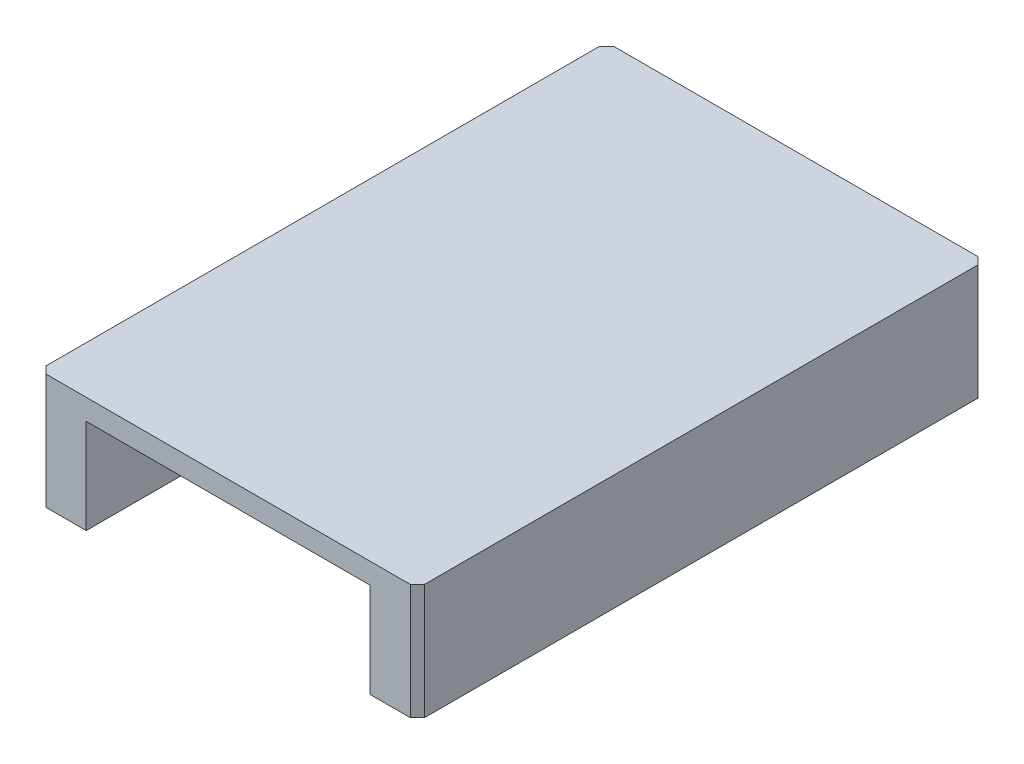
ISO-10303-21;
HEADER;
FILE_DESCRIPTION(('STEP AP214'),'2;1');
FILE_NAME('part.step','',(''),(''),'','','');
FILE_SCHEMA(('AUTOMOTIVE_DESIGN { 1 0 10303 214 1 1 1 1 }'));
ENDSEC;
DATA;
#1=APPLICATION_CONTEXT('core data for automotive mechanical design processes');
#2=APPLICATION_PROTOCOL_DEFINITION('international standard','automotive_design',2000,#1);
#3=PRODUCT_CONTEXT('',#1,'mechanical');
#4=PRODUCT('Part','Part','',(#3));
#5=PRODUCT_RELATED_PRODUCT_CATEGORY('part','',(#4));
#6=PRODUCT_DEFINITION_FORMATION('','',#4);
#7=PRODUCT_DEFINITION_CONTEXT('part definition',#1,'design');
#8=PRODUCT_DEFINITION('design','',#6,#7);
#9=PRODUCT_DEFINITION_SHAPE('','',#8);
#10=(LENGTH_UNIT() NAMED_UNIT(*) SI_UNIT(.MILLI.,.METRE.));
#11=(NAMED_UNIT(*) PLANE_ANGLE_UNIT() SI_UNIT($,.RADIAN.));
#12=(NAMED_UNIT(*) SI_UNIT($,.STERADIAN.) SOLID_ANGLE_UNIT());
#13=UNCERTAINTY_MEASURE_WITH_UNIT(LENGTH_MEASURE(1.E-05),#10,'distance_accuracy_value','');
#14=(GEOMETRIC_REPRESENTATION_CONTEXT(3) GLOBAL_UNCERTAINTY_ASSIGNED_CONTEXT((#13)) GLOBAL_UNIT_ASSIGNED_CONTEXT((#10,
#11,#12)) REPRESENTATION_CONTEXT('',''));
#15=CARTESIAN_POINT('',(0.,0.,0.));
#16=DIRECTION('',(0.,0.,1.));
#17=DIRECTION('',(1.,0.,0.));
#18=AXIS2_PLACEMENT_3D('',#15,#16,#17);
#19=CARTESIAN_POINT('',(40.,0.,0.));
#20=DIRECTION('',(-1.,0.,0.));
#21=DIRECTION('',(0.,0.,1.));
#22=AXIS2_PLACEMENT_3D('',#19,#20,#21);
#23=PLANE('',#22);
#24=DIRECTION('',(0.,-1.,0.));
#25=VECTOR('',#24,1.);
#26=CARTESIAN_POINT('',(40.,0.,-0.750000000000001));
#27=LINE('',#26,#25);
#28=CARTESIAN_POINT('',(40.,7.19999999999999,-0.750000000000001));
#29=VERTEX_POINT('',#28);
#30=CARTESIAN_POINT('',(40.,-5.,-0.750000000000001));
#31=VERTEX_POINT('',#30);
#32=EDGE_CURVE('E219',#29,#31,#27,.T.);
#33=ORIENTED_EDGE('',*,*,#32,.T.);
#34=DIRECTION('',(0.,0.,1.));
#35=VECTOR('',#34,1.);
#36=CARTESIAN_POINT('',(40.,-4.99999999999999,-59.25));
#37=LINE('',#36,#35);
#38=CARTESIAN_POINT('',(40.,-4.99999999999999,-59.25));
#39=VERTEX_POINT('',#38);
#40=EDGE_CURVE('E165',#39,#31,#37,.T.);
#41=ORIENTED_EDGE('',*,*,#40,.F.);
#42=DIRECTION('',(0.,1.,0.));
#43=VECTOR('',#42,1.);
#44=CARTESIAN_POINT('',(40.,0.,-59.25));
#45=LINE('',#44,#43);
#46=CARTESIAN_POINT('',(40.,7.19999999999999,-59.25));
#47=VERTEX_POINT('',#46);
#48=EDGE_CURVE('E221',#39,#47,#45,.T.);
#49=ORIENTED_EDGE('',*,*,#48,.T.);
#50=DIRECTION('',(0.,0.,1.));
#51=VECTOR('',#50,1.);
#52=CARTESIAN_POINT('',(40.,7.19999999999999,0.));
#53=LINE('',#52,#51);
#54=EDGE_CURVE('E199',#47,#29,#53,.T.);
#55=ORIENTED_EDGE('',*,*,#54,.T.);
#56=EDGE_LOOP('',(#33,#41,#49,#55));
#57=FACE_BOUND('',#56,.T.);
#58=ADVANCED_FACE('F43',(#57),#23,.F.);
#59=CARTESIAN_POINT('',(0.,0.,0.));
#60=DIRECTION('',(-1.,0.,0.));
#61=DIRECTION('',(0.,0.,1.));
#62=AXIS2_PLACEMENT_3D('',#59,#60,#61);
#63=PLANE('',#62);
#64=DIRECTION('',(0.,0.,1.));
#65=VECTOR('',#64,1.);
#66=CARTESIAN_POINT('',(0.,7.19999999999999,0.));
#67=LINE('',#66,#65);
#68=CARTESIAN_POINT('',(0.,7.19999999999999,-59.25));
#69=VERTEX_POINT('',#68);
#70=CARTESIAN_POINT('',(0.,7.19999999999999,-0.750000000000001));
#71=VERTEX_POINT('',#70);
#72=EDGE_CURVE('E198',#69,#71,#67,.T.);
#73=ORIENTED_EDGE('',*,*,#72,.F.);
#74=DIRECTION('',(0.,-1.,0.));
#75=VECTOR('',#74,1.);
#76=CARTESIAN_POINT('',(0.,0.,-59.25));
#77=LINE('',#76,#75);
#78=CARTESIAN_POINT('',(0.,-4.99999999999999,-59.25));
#79=VERTEX_POINT('',#78);
#80=EDGE_CURVE('E217',#69,#79,#77,.T.);
#81=ORIENTED_EDGE('',*,*,#80,.T.);
#82=DIRECTION('',(0.,0.,-1.));
#83=VECTOR('',#82,1.);
#84=CARTESIAN_POINT('',(0.,-5.,-0.750000000000001));
#85=LINE('',#84,#83);
#86=CARTESIAN_POINT('',(0.,-5.,-0.750000000000001));
#87=VERTEX_POINT('',#86);
#88=EDGE_CURVE('E176',#87,#79,#85,.T.);
#89=ORIENTED_EDGE('',*,*,#88,.F.);
#90=DIRECTION('',(0.,1.,0.));
#91=VECTOR('',#90,1.);
#92=CARTESIAN_POINT('',(0.,7.19999999999999,-0.750000000000002));
#93=LINE('',#92,#91);
#94=EDGE_CURVE('E215',#87,#71,#93,.T.);
#95=ORIENTED_EDGE('',*,*,#94,.T.);
#96=EDGE_LOOP('',(#73,#81,#89,#95));
#97=FACE_BOUND('',#96,.T.);
#98=ADVANCED_FACE('F238',(#97),#63,.T.);
#99=CARTESIAN_POINT('',(40.,7.19999999999999,-60.));
#100=DIRECTION('',(0.,0.,1.));
#101=DIRECTION('',(0.,-1.,0.));
#102=AXIS2_PLACEMENT_3D('',#99,#100,#101);
#103=PLANE('',#102);
#104=DIRECTION('',(0.,-1.,0.));
#105=VECTOR('',#104,1.);
#106=CARTESIAN_POINT('',(39.25,7.19999999999999,-60.));
#107=LINE('',#106,#105);
#108=CARTESIAN_POINT('',(39.25,7.19999999999999,-60.));
#109=VERTEX_POINT('',#108);
#110=CARTESIAN_POINT('',(39.25,-4.99999999999999,-60.));
#111=VERTEX_POINT('',#110);
#112=EDGE_CURVE('E206',#109,#111,#107,.T.);
#113=ORIENTED_EDGE('',*,*,#112,.T.);
#114=DIRECTION('',(1.,0.,0.));
#115=VECTOR('',#114,1.);
#116=CARTESIAN_POINT('',(35.,-4.99999999999999,-60.));
#117=LINE('',#116,#115);
#118=CARTESIAN_POINT('',(35.,-4.99999999999999,-60.));
#119=VERTEX_POINT('',#118);
#120=EDGE_CURVE('E152',#119,#111,#117,.T.);
#121=ORIENTED_EDGE('',*,*,#120,.F.);
#122=DIRECTION('',(0.,1.,0.));
#123=VECTOR('',#122,1.);
#124=CARTESIAN_POINT('',(35.,0.,-60.));
#125=LINE('',#124,#123);
#126=CARTESIAN_POINT('',(35.,4.99999999999999,-60.));
#127=VERTEX_POINT('',#126);
#128=EDGE_CURVE('E148',#119,#127,#125,.T.);
#129=ORIENTED_EDGE('',*,*,#128,.T.);
#130=DIRECTION('',(-1.,0.,0.));
#131=VECTOR('',#130,1.);
#132=CARTESIAN_POINT('',(35.,4.99999999999999,-60.));
#133=LINE('',#132,#131);
#134=CARTESIAN_POINT('',(5.,4.99999999999999,-60.));
#135=VERTEX_POINT('',#134);
#136=EDGE_CURVE('E142',#127,#135,#133,.T.);
#137=ORIENTED_EDGE('',*,*,#136,.T.);
#138=DIRECTION('',(0.,-1.,0.));
#139=VECTOR('',#138,1.);
#140=CARTESIAN_POINT('',(5.,0.,-60.));
#141=LINE('',#140,#139);
#142=CARTESIAN_POINT('',(5.,-4.99999999999999,-60.));
#143=VERTEX_POINT('',#142);
#144=EDGE_CURVE('E192',#135,#143,#141,.T.);
#145=ORIENTED_EDGE('',*,*,#144,.T.);
#146=DIRECTION('',(1.,0.,0.));
#147=VECTOR('',#146,1.);
#148=CARTESIAN_POINT('',(0.750000000000008,-4.99999999999999,-60.));
#149=LINE('',#148,#147);
#150=CARTESIAN_POINT('',(0.750000000000008,-4.99999999999999,-60.));
#151=VERTEX_POINT('',#150);
#152=EDGE_CURVE('E182',#151,#143,#149,.T.);
#153=ORIENTED_EDGE('',*,*,#152,.F.);
#154=DIRECTION('',(0.,1.,0.));
#155=VECTOR('',#154,1.);
#156=CARTESIAN_POINT('',(0.750000000000008,7.19999999999999,-60.));
#157=LINE('',#156,#155);
#158=CARTESIAN_POINT('',(0.750000000000008,7.19999999999999,-60.));
#159=VERTEX_POINT('',#158);
#160=EDGE_CURVE('E208',#151,#159,#157,.T.);
#161=ORIENTED_EDGE('',*,*,#160,.T.);
#162=DIRECTION('',(-1.,0.,0.));
#163=VECTOR('',#162,1.);
#164=CARTESIAN_POINT('',(40.,7.19999999999999,-60.));
#165=LINE('',#164,#163);
#166=EDGE_CURVE('E204',#109,#159,#165,.T.);
#167=ORIENTED_EDGE('',*,*,#166,.F.);
#168=EDGE_LOOP('',(#113,#121,#129,#137,#145,#153,#161,#167));
#169=FACE_BOUND('',#168,.T.);
#170=ADVANCED_FACE('F247',(#169),#103,.F.);
#171=CARTESIAN_POINT('',(40.,7.19999999999999,0.));
#172=DIRECTION('',(0.,-1.,0.));
#173=DIRECTION('',(0.,0.,-1.));
#174=AXIS2_PLACEMENT_3D('',#171,#172,#173);
#175=PLANE('',#174);
#176=DIRECTION('',(0.707106781186548,0.,0.707106781186548));
#177=VECTOR('',#176,1.);
#178=CARTESIAN_POINT('',(0.750000000000002,7.19999999999999,0.));
#179=LINE('',#178,#177);
#180=CARTESIAN_POINT('',(0.750000000000001,7.19999999999999,0.));
#181=VERTEX_POINT('',#180);
#182=EDGE_CURVE('E211',#71,#181,#179,.T.);
#183=ORIENTED_EDGE('',*,*,#182,.T.);
#184=DIRECTION('',(-1.,0.,0.));
#185=VECTOR('',#184,1.);
#186=CARTESIAN_POINT('',(40.,7.19999999999999,0.));
#187=LINE('',#186,#185);
#188=CARTESIAN_POINT('',(39.25,7.19999999999999,0.));
#189=VERTEX_POINT('',#188);
#190=EDGE_CURVE('E59',#189,#181,#187,.T.);
#191=ORIENTED_EDGE('',*,*,#190,.F.);
#192=DIRECTION('',(-0.707106781186548,0.,0.707106781186548));
#193=VECTOR('',#192,1.);
#194=CARTESIAN_POINT('',(40.,7.19999999999999,-0.750000000000001));
#195=LINE('',#194,#193);
#196=EDGE_CURVE('E63',#189,#29,#195,.F.);
#197=ORIENTED_EDGE('',*,*,#196,.T.);
#198=ORIENTED_EDGE('',*,*,#54,.F.);
#199=DIRECTION('',(0.707106781186544,0.,0.707106781186551));
#200=VECTOR('',#199,1.);
#201=CARTESIAN_POINT('',(40.,7.19999999999999,-59.25));
#202=LINE('',#201,#200);
#203=EDGE_CURVE('E225',#47,#109,#202,.F.);
#204=ORIENTED_EDGE('',*,*,#203,.T.);
#205=ORIENTED_EDGE('',*,*,#166,.T.);
#206=DIRECTION('',(-0.707106781186548,0.,0.707106781186548));
#207=VECTOR('',#206,1.);
#208=CARTESIAN_POINT('',(0.750000000000008,7.19999999999999,-60.));
#209=LINE('',#208,#207);
#210=EDGE_CURVE('E213',#159,#69,#209,.T.);
#211=ORIENTED_EDGE('',*,*,#210,.T.);
#212=ORIENTED_EDGE('',*,*,#72,.T.);
#213=EDGE_LOOP('',(#183,#191,#197,#198,#204,#205,#211,#212));
#214=FACE_BOUND('',#213,.T.);
#215=ADVANCED_FACE('F240',(#214),#175,.F.);
#216=CARTESIAN_POINT('',(40.,0.,0.));
#217=DIRECTION('',(0.,0.,-1.));
#218=DIRECTION('',(0.,1.,0.));
#219=AXIS2_PLACEMENT_3D('',#216,#217,#218);
#220=PLANE('',#219);
#221=DIRECTION('',(0.,-1.,0.));
#222=VECTOR('',#221,1.);
#223=CARTESIAN_POINT('',(0.750000000000001,0.,0.));
#224=LINE('',#223,#222);
#225=CARTESIAN_POINT('',(0.750000000000001,-5.,0.));
#226=VERTEX_POINT('',#225);
#227=EDGE_CURVE('E52',#181,#226,#224,.T.);
#228=ORIENTED_EDGE('',*,*,#227,.T.);
#229=DIRECTION('',(-1.,0.,0.));
#230=VECTOR('',#229,1.);
#231=CARTESIAN_POINT('',(5.,-5.,0.));
#232=LINE('',#231,#230);
#233=CARTESIAN_POINT('',(5.,-5.,0.));
#234=VERTEX_POINT('',#233);
#235=EDGE_CURVE('E170',#234,#226,#232,.T.);
#236=ORIENTED_EDGE('',*,*,#235,.F.);
#237=DIRECTION('',(0.,-1.,0.));
#238=VECTOR('',#237,1.);
#239=CARTESIAN_POINT('',(5.,0.,0.));
#240=LINE('',#239,#238);
#241=CARTESIAN_POINT('',(5.,4.99999999999999,0.));
#242=VERTEX_POINT('',#241);
#243=EDGE_CURVE('E191',#242,#234,#240,.T.);
#244=ORIENTED_EDGE('',*,*,#243,.F.);
#245=DIRECTION('',(-1.,0.,0.));
#246=VECTOR('',#245,1.);
#247=CARTESIAN_POINT('',(35.,4.99999999999999,0.));
#248=LINE('',#247,#246);
#249=CARTESIAN_POINT('',(35.,4.99999999999999,0.));
#250=VERTEX_POINT('',#249);
#251=EDGE_CURVE('E140',#250,#242,#248,.T.);
#252=ORIENTED_EDGE('',*,*,#251,.F.);
#253=DIRECTION('',(0.,1.,0.));
#254=VECTOR('',#253,1.);
#255=CARTESIAN_POINT('',(35.,0.,0.));
#256=LINE('',#255,#254);
#257=CARTESIAN_POINT('',(35.,-5.,0.));
#258=VERTEX_POINT('',#257);
#259=EDGE_CURVE('E133',#258,#250,#256,.T.);
#260=ORIENTED_EDGE('',*,*,#259,.F.);
#261=DIRECTION('',(-1.,0.,0.));
#262=VECTOR('',#261,1.);
#263=CARTESIAN_POINT('',(39.25,-5.,0.));
#264=LINE('',#263,#262);
#265=CARTESIAN_POINT('',(39.25,-5.,0.));
#266=VERTEX_POINT('',#265);
#267=EDGE_CURVE('E137',#266,#258,#264,.T.);
#268=ORIENTED_EDGE('',*,*,#267,.F.);
#269=DIRECTION('',(0.,1.,0.));
#270=VECTOR('',#269,1.);
#271=CARTESIAN_POINT('',(39.25,0.,0.));
#272=LINE('',#271,#270);
#273=EDGE_CURVE('E11',#266,#189,#272,.T.);
#274=ORIENTED_EDGE('',*,*,#273,.T.);
#275=ORIENTED_EDGE('',*,*,#190,.T.);
#276=EDGE_LOOP('',(#228,#236,#244,#252,#260,#268,#274,#275));
#277=FACE_BOUND('',#276,.T.);
#278=ADVANCED_FACE('F135',(#277),#220,.F.);
#279=CARTESIAN_POINT('',(5.,0.,-60.));
#280=DIRECTION('',(-1.,0.,0.));
#281=DIRECTION('',(0.,0.,1.));
#282=AXIS2_PLACEMENT_3D('',#279,#280,#281);
#283=PLANE('',#282);
#284=ORIENTED_EDGE('',*,*,#243,.T.);
#285=DIRECTION('',(0.,0.,1.));
#286=VECTOR('',#285,1.);
#287=CARTESIAN_POINT('',(5.,-4.99999999999999,-60.));
#288=LINE('',#287,#286);
#289=EDGE_CURVE('E168',#143,#234,#288,.T.);
#290=ORIENTED_EDGE('',*,*,#289,.F.);
#291=ORIENTED_EDGE('',*,*,#144,.F.);
#292=DIRECTION('',(0.,0.,1.));
#293=VECTOR('',#292,1.);
#294=CARTESIAN_POINT('',(5.,4.99999999999999,-60.));
#295=LINE('',#294,#293);
#296=EDGE_CURVE('E194',#135,#242,#295,.T.);
#297=ORIENTED_EDGE('',*,*,#296,.T.);
#298=EDGE_LOOP('',(#284,#290,#291,#297));
#299=FACE_BOUND('',#298,.T.);
#300=ADVANCED_FACE('F251',(#299),#283,.F.);
#301=CARTESIAN_POINT('',(35.,4.99999999999999,-60.));
#302=DIRECTION('',(0.,1.,0.));
#303=DIRECTION('',(-1.,0.,0.));
#304=AXIS2_PLACEMENT_3D('',#301,#302,#303);
#305=PLANE('',#304);
#306=ORIENTED_EDGE('',*,*,#136,.F.);
#307=DIRECTION('',(0.,0.,1.));
#308=VECTOR('',#307,1.);
#309=CARTESIAN_POINT('',(35.,4.99999999999999,-60.));
#310=LINE('',#309,#308);
#311=EDGE_CURVE('E188',#127,#250,#310,.T.);
#312=ORIENTED_EDGE('',*,*,#311,.T.);
#313=ORIENTED_EDGE('',*,*,#251,.T.);
#314=ORIENTED_EDGE('',*,*,#296,.F.);
#315=EDGE_LOOP('',(#306,#312,#313,#314));
#316=FACE_BOUND('',#315,.T.);
#317=ADVANCED_FACE('F253',(#316),#305,.F.);
#318=CARTESIAN_POINT('',(35.,0.,-60.));
#319=DIRECTION('',(1.,0.,0.));
#320=DIRECTION('',(0.,1.,0.));
#321=AXIS2_PLACEMENT_3D('',#318,#319,#320);
#322=PLANE('',#321);
#323=ORIENTED_EDGE('',*,*,#128,.F.);
#324=DIRECTION('',(0.,0.,-1.));
#325=VECTOR('',#324,1.);
#326=CARTESIAN_POINT('',(35.,-5.,0.));
#327=LINE('',#326,#325);
#328=EDGE_CURVE('E145',#258,#119,#327,.T.);
#329=ORIENTED_EDGE('',*,*,#328,.F.);
#330=ORIENTED_EDGE('',*,*,#259,.T.);
#331=ORIENTED_EDGE('',*,*,#311,.F.);
#332=EDGE_LOOP('',(#323,#329,#330,#331));
#333=FACE_BOUND('',#332,.T.);
#334=ADVANCED_FACE('F146',(#333),#322,.F.);
#335=CARTESIAN_POINT('',(0.750000000000008,7.19999999999999,-60.));
#336=DIRECTION('',(-0.707106781186547,0.,-0.707106781186547));
#337=DIRECTION('',(0.,-1.,0.));
#338=AXIS2_PLACEMENT_3D('',#335,#336,#337);
#339=PLANE('',#338);
#340=ORIENTED_EDGE('',*,*,#160,.F.);
#341=DIRECTION('',(0.707106781186547,0.,-0.707106781186547));
#342=VECTOR('',#341,1.);
#343=CARTESIAN_POINT('',(0.,-4.99999999999999,-59.25));
#344=LINE('',#343,#342);
#345=EDGE_CURVE('E179',#79,#151,#344,.T.);
#346=ORIENTED_EDGE('',*,*,#345,.F.);
#347=ORIENTED_EDGE('',*,*,#80,.F.);
#348=ORIENTED_EDGE('',*,*,#210,.F.);
#349=EDGE_LOOP('',(#340,#346,#347,#348));
#350=FACE_BOUND('',#349,.T.);
#351=ADVANCED_FACE('F243',(#350),#339,.T.);
#352=CARTESIAN_POINT('',(40.,0.,-59.25));
#353=DIRECTION('',(-0.707106781186551,0.,0.707106781186544));
#354=DIRECTION('',(0.,1.,0.));
#355=AXIS2_PLACEMENT_3D('',#352,#353,#354);
#356=PLANE('',#355);
#357=ORIENTED_EDGE('',*,*,#48,.F.);
#358=DIRECTION('',(0.707106781186544,0.,0.707106781186551));
#359=VECTOR('',#358,1.);
#360=CARTESIAN_POINT('',(39.25,-4.99999999999999,-60.));
#361=LINE('',#360,#359);
#362=EDGE_CURVE('E162',#111,#39,#361,.T.);
#363=ORIENTED_EDGE('',*,*,#362,.F.);
#364=ORIENTED_EDGE('',*,*,#112,.F.);
#365=ORIENTED_EDGE('',*,*,#203,.F.);
#366=EDGE_LOOP('',(#357,#363,#364,#365));
#367=FACE_BOUND('',#366,.T.);
#368=ADVANCED_FACE('F258',(#367),#356,.F.);
#369=CARTESIAN_POINT('',(40.,0.,-0.750000000000001));
#370=DIRECTION('',(-0.707106781186547,0.,-0.707106781186547));
#371=DIRECTION('',(0.,-1.,0.));
#372=AXIS2_PLACEMENT_3D('',#369,#370,#371);
#373=PLANE('',#372);
#374=ORIENTED_EDGE('',*,*,#196,.F.);
#375=ORIENTED_EDGE('',*,*,#273,.F.);
#376=DIRECTION('',(-0.707106781186547,0.,0.707106781186547));
#377=VECTOR('',#376,1.);
#378=CARTESIAN_POINT('',(40.,-5.,-0.750000000000001));
#379=LINE('',#378,#377);
#380=EDGE_CURVE('E158',#31,#266,#379,.T.);
#381=ORIENTED_EDGE('',*,*,#380,.F.);
#382=ORIENTED_EDGE('',*,*,#32,.F.);
#383=EDGE_LOOP('',(#374,#375,#381,#382));
#384=FACE_BOUND('',#383,.T.);
#385=ADVANCED_FACE('F262',(#384),#373,.F.);
#386=CARTESIAN_POINT('',(0.750000000000001,0.,0.));
#387=DIRECTION('',(-0.707106781186547,0.,0.707106781186547));
#388=DIRECTION('',(0.,1.,0.));
#389=AXIS2_PLACEMENT_3D('',#386,#387,#388);
#390=PLANE('',#389);
#391=ORIENTED_EDGE('',*,*,#182,.F.);
#392=ORIENTED_EDGE('',*,*,#94,.F.);
#393=DIRECTION('',(-0.707106781186547,0.,-0.707106781186547));
#394=VECTOR('',#393,1.);
#395=CARTESIAN_POINT('',(0.750000000000001,-5.,0.));
#396=LINE('',#395,#394);
#397=EDGE_CURVE('E173',#226,#87,#396,.T.);
#398=ORIENTED_EDGE('',*,*,#397,.F.);
#399=ORIENTED_EDGE('',*,*,#227,.F.);
#400=EDGE_LOOP('',(#391,#392,#398,#399));
#401=FACE_BOUND('',#400,.T.);
#402=ADVANCED_FACE('F46',(#401),#390,.T.);
#403=CARTESIAN_POINT('',(0.,-5.,0.));
#404=DIRECTION('',(0.,-1.,0.));
#405=DIRECTION('',(0.,0.,-1.));
#406=AXIS2_PLACEMENT_3D('',#403,#404,#405);
#407=PLANE('',#406);
#408=ORIENTED_EDGE('',*,*,#289,.T.);
#409=ORIENTED_EDGE('',*,*,#235,.T.);
#410=ORIENTED_EDGE('',*,*,#397,.T.);
#411=ORIENTED_EDGE('',*,*,#88,.T.);
#412=ORIENTED_EDGE('',*,*,#345,.T.);
#413=ORIENTED_EDGE('',*,*,#152,.T.);
#414=EDGE_LOOP('',(#408,#409,#410,#411,#412,#413));
#415=FACE_BOUND('',#414,.T.);
#416=ADVANCED_FACE('F233',(#415),#407,.T.);
#417=CARTESIAN_POINT('',(0.,-5.,0.));
#418=DIRECTION('',(0.,-1.,0.));
#419=DIRECTION('',(0.,0.,-1.));
#420=AXIS2_PLACEMENT_3D('',#417,#418,#419);
#421=PLANE('',#420);
#422=ORIENTED_EDGE('',*,*,#267,.T.);
#423=ORIENTED_EDGE('',*,*,#328,.T.);
#424=ORIENTED_EDGE('',*,*,#120,.T.);
#425=ORIENTED_EDGE('',*,*,#362,.T.);
#426=ORIENTED_EDGE('',*,*,#40,.T.);
#427=ORIENTED_EDGE('',*,*,#380,.T.);
#428=EDGE_LOOP('',(#422,#423,#424,#425,#426,#427));
#429=FACE_BOUND('',#428,.T.);
#430=ADVANCED_FACE('F155',(#429),#421,.T.);
#431=CLOSED_SHELL('',(#58,#98,#170,#215,#278,#300,#317,#334,#351,#368,#385,#402,#416,#430));
#432=MANIFOLD_SOLID_BREP('B2',#431);
#433=ADVANCED_BREP_SHAPE_REPRESENTATION('',(#18,#432),#14);
#434=SHAPE_DEFINITION_REPRESENTATION(#9,#433);
ENDSEC;
END-ISO-10303-21;
